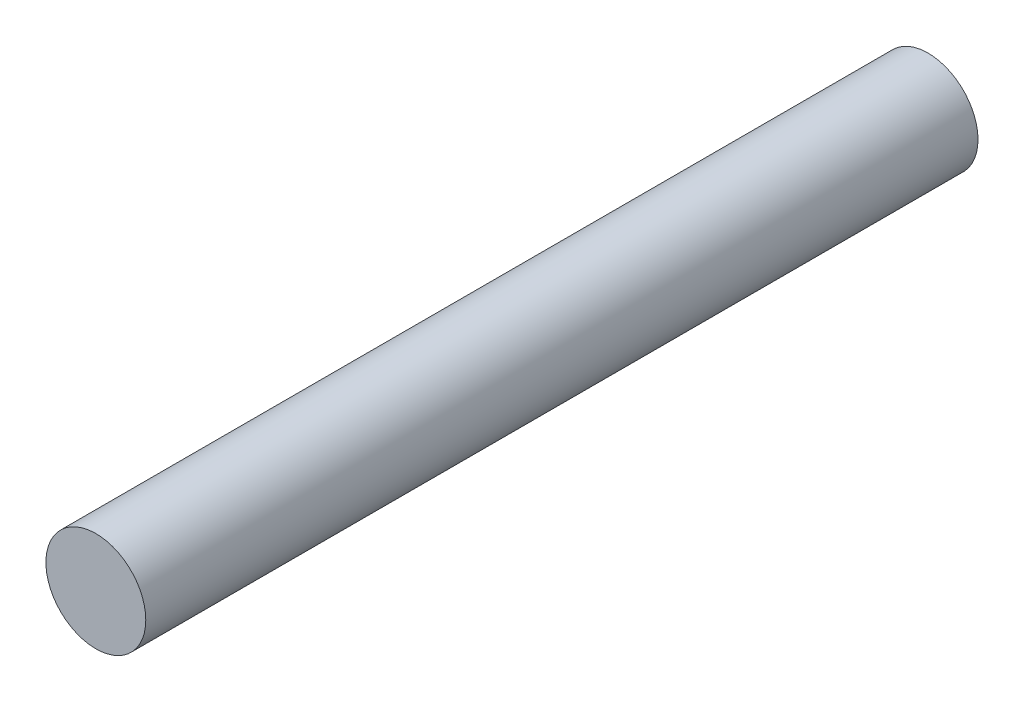
ISO-10303-21;
HEADER;
FILE_DESCRIPTION(('STEP AP214'),'2;1');
FILE_NAME('part.step','',(''),(''),'','','');
FILE_SCHEMA(('AUTOMOTIVE_DESIGN { 1 0 10303 214 1 1 1 1 }'));
ENDSEC;
DATA;
#1=APPLICATION_CONTEXT('core data for automotive mechanical design processes');
#2=APPLICATION_PROTOCOL_DEFINITION('international standard','automotive_design',2000,#1);
#3=PRODUCT_CONTEXT('',#1,'mechanical');
#4=PRODUCT('Part','Part','',(#3));
#5=PRODUCT_RELATED_PRODUCT_CATEGORY('part','',(#4));
#6=PRODUCT_DEFINITION_FORMATION('','',#4);
#7=PRODUCT_DEFINITION_CONTEXT('part definition',#1,'design');
#8=PRODUCT_DEFINITION('design','',#6,#7);
#9=PRODUCT_DEFINITION_SHAPE('','',#8);
#10=(LENGTH_UNIT() NAMED_UNIT(*) SI_UNIT(.MILLI.,.METRE.));
#11=(NAMED_UNIT(*) PLANE_ANGLE_UNIT() SI_UNIT($,.RADIAN.));
#12=(NAMED_UNIT(*) SI_UNIT($,.STERADIAN.) SOLID_ANGLE_UNIT());
#13=UNCERTAINTY_MEASURE_WITH_UNIT(LENGTH_MEASURE(1.E-05),#10,'distance_accuracy_value','');
#14=(GEOMETRIC_REPRESENTATION_CONTEXT(3) GLOBAL_UNCERTAINTY_ASSIGNED_CONTEXT((#13)) GLOBAL_UNIT_ASSIGNED_CONTEXT((#10,
#11,#12)) REPRESENTATION_CONTEXT('',''));
#15=CARTESIAN_POINT('',(0.,0.,0.));
#16=DIRECTION('',(0.,0.,1.));
#17=DIRECTION('',(1.,0.,0.));
#18=AXIS2_PLACEMENT_3D('',#15,#16,#17);
#19=CARTESIAN_POINT('',(0.,0.,25.));
#20=DIRECTION('',(0.,0.,-1.));
#21=DIRECTION('',(-1.,0.,0.));
#22=AXIS2_PLACEMENT_3D('',#19,#20,#21);
#23=CYLINDRICAL_SURFACE('',#22,1.5);
#24=CARTESIAN_POINT('',(0.,0.,25.));
#25=DIRECTION('',(0.,0.,1.));
#26=DIRECTION('',(1.,0.,0.));
#27=AXIS2_PLACEMENT_3D('',#24,#25,#26);
#28=CIRCLE('',#27,1.5);
#29=CARTESIAN_POINT('',(1.5,0.,25.));
#30=VERTEX_POINT('',#29);
#31=EDGE_CURVE('E10',#30,#30,#28,.T.);
#32=ORIENTED_EDGE('',*,*,#31,.F.);
#33=EDGE_LOOP('',(#32));
#34=FACE_BOUND('',#33,.T.);
#35=CARTESIAN_POINT('',(0.,0.,0.));
#36=DIRECTION('',(0.,0.,1.));
#37=DIRECTION('',(1.,0.,0.));
#38=AXIS2_PLACEMENT_3D('',#35,#36,#37);
#39=CIRCLE('',#38,1.5);
#40=CARTESIAN_POINT('',(1.5,0.,0.));
#41=VERTEX_POINT('',#40);
#42=EDGE_CURVE('E34',#41,#41,#39,.T.);
#43=ORIENTED_EDGE('',*,*,#42,.T.);
#44=EDGE_LOOP('',(#43));
#45=FACE_BOUND('',#44,.T.);
#46=ADVANCED_FACE('F31',(#34,#45),#23,.T.);
#47=CARTESIAN_POINT('',(0.,0.,25.));
#48=DIRECTION('',(0.,0.,1.));
#49=DIRECTION('',(1.,0.,0.));
#50=AXIS2_PLACEMENT_3D('',#47,#48,#49);
#51=PLANE('',#50);
#52=ORIENTED_EDGE('',*,*,#31,.T.);
#53=EDGE_LOOP('',(#52));
#54=FACE_BOUND('',#53,.T.);
#55=ADVANCED_FACE('F46',(#54),#51,.T.);
#56=CARTESIAN_POINT('',(0.,0.,0.));
#57=DIRECTION('',(0.,0.,1.));
#58=DIRECTION('',(1.,0.,0.));
#59=AXIS2_PLACEMENT_3D('',#56,#57,#58);
#60=PLANE('',#59);
#61=ORIENTED_EDGE('',*,*,#42,.F.);
#62=EDGE_LOOP('',(#61));
#63=FACE_BOUND('',#62,.T.);
#64=ADVANCED_FACE('F44',(#63),#60,.F.);
#65=CLOSED_SHELL('',(#46,#55,#64));
#66=MANIFOLD_SOLID_BREP('B2',#65);
#67=ADVANCED_BREP_SHAPE_REPRESENTATION('',(#18,#66),#14);
#68=SHAPE_DEFINITION_REPRESENTATION(#9,#67);
ENDSEC;
END-ISO-10303-21;
